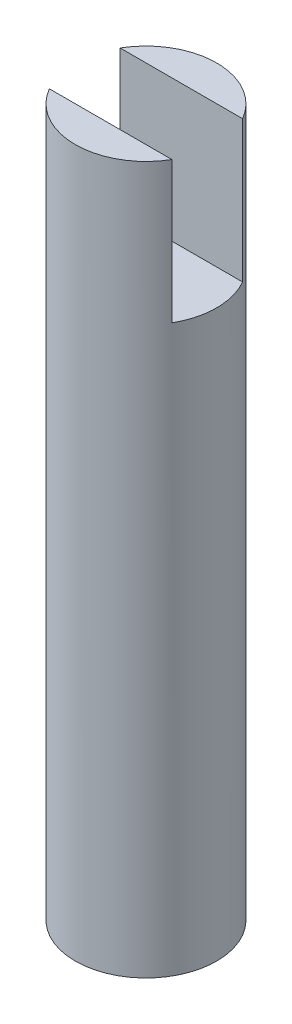
ISO-10303-21;
HEADER;
FILE_DESCRIPTION(('STEP AP214'),'2;1');
FILE_NAME('part.step','',(''),(''),'','','');
FILE_SCHEMA(('AUTOMOTIVE_DESIGN { 1 0 10303 214 1 1 1 1 }'));
ENDSEC;
DATA;
#1=APPLICATION_CONTEXT('core data for automotive mechanical design processes');
#2=APPLICATION_PROTOCOL_DEFINITION('international standard','automotive_design',2000,#1);
#3=PRODUCT_CONTEXT('',#1,'mechanical');
#4=PRODUCT('Part','Part','',(#3));
#5=PRODUCT_RELATED_PRODUCT_CATEGORY('part','',(#4));
#6=PRODUCT_DEFINITION_FORMATION('','',#4);
#7=PRODUCT_DEFINITION_CONTEXT('part definition',#1,'design');
#8=PRODUCT_DEFINITION('design','',#6,#7);
#9=PRODUCT_DEFINITION_SHAPE('','',#8);
#10=(LENGTH_UNIT() NAMED_UNIT(*) SI_UNIT(.MILLI.,.METRE.));
#11=(NAMED_UNIT(*) PLANE_ANGLE_UNIT() SI_UNIT($,.RADIAN.));
#12=(NAMED_UNIT(*) SI_UNIT($,.STERADIAN.) SOLID_ANGLE_UNIT());
#13=UNCERTAINTY_MEASURE_WITH_UNIT(LENGTH_MEASURE(1.E-05),#10,'distance_accuracy_value','');
#14=(GEOMETRIC_REPRESENTATION_CONTEXT(3) GLOBAL_UNCERTAINTY_ASSIGNED_CONTEXT((#13)) GLOBAL_UNIT_ASSIGNED_CONTEXT((#10,
#11,#12)) REPRESENTATION_CONTEXT('',''));
#15=CARTESIAN_POINT('',(0.,0.,0.));
#16=DIRECTION('',(0.,0.,1.));
#17=DIRECTION('',(1.,0.,0.));
#18=AXIS2_PLACEMENT_3D('',#15,#16,#17);
#19=CARTESIAN_POINT('',(0.,5.,0.));
#20=DIRECTION('',(0.,1.,0.));
#21=DIRECTION('',(0.,0.,1.));
#22=AXIS2_PLACEMENT_3D('',#19,#20,#21);
#23=PLANE('',#22);
#24=DIRECTION('',(1.,0.,0.));
#25=VECTOR('',#24,1.);
#26=CARTESIAN_POINT('',(0.,5.,2.5));
#27=LINE('',#26,#25);
#28=CARTESIAN_POINT('',(-4.33012701892219,5.,2.5));
#29=VERTEX_POINT('',#28);
#30=CARTESIAN_POINT('',(4.33012701892219,5.,2.5));
#31=VERTEX_POINT('',#30);
#32=EDGE_CURVE('E63',#29,#31,#27,.T.);
#33=ORIENTED_EDGE('',*,*,#32,.F.);
#34=CARTESIAN_POINT('',(0.,5.,0.));
#35=DIRECTION('',(0.,1.,0.));
#36=DIRECTION('',(0.,0.,1.));
#37=AXIS2_PLACEMENT_3D('',#34,#35,#36);
#38=CIRCLE('',#37,5.);
#39=EDGE_CURVE('E97',#29,#31,#38,.T.);
#40=ORIENTED_EDGE('',*,*,#39,.T.);
#41=EDGE_LOOP('',(#33,#40));
#42=FACE_BOUND('',#41,.T.);
#43=ADVANCED_FACE('F40',(#42),#23,.T.);
#44=CARTESIAN_POINT('',(0.,-45.,0.));
#45=DIRECTION('',(0.,1.,0.));
#46=DIRECTION('',(0.,0.,1.));
#47=AXIS2_PLACEMENT_3D('',#44,#45,#46);
#48=CYLINDRICAL_SURFACE('',#47,5.);
#49=DIRECTION('',(0.,1.,0.));
#50=VECTOR('',#49,1.);
#51=CARTESIAN_POINT('',(-4.3301270189222,-45.,-2.5));
#52=LINE('',#51,#50);
#53=CARTESIAN_POINT('',(-4.33012701892219,5.,-2.5));
#54=VERTEX_POINT('',#53);
#55=CARTESIAN_POINT('',(-4.33012701892219,-5.,-2.5));
#56=VERTEX_POINT('',#55);
#57=EDGE_CURVE('E83',#54,#56,#52,.F.);
#58=ORIENTED_EDGE('',*,*,#57,.F.);
#59=CARTESIAN_POINT('',(4.33012701892219,5.,-2.5));
#60=VERTEX_POINT('',#59);
#61=EDGE_CURVE('E92',#60,#54,#38,.T.);
#62=ORIENTED_EDGE('',*,*,#61,.F.);
#63=DIRECTION('',(0.,1.,0.));
#64=VECTOR('',#63,1.);
#65=CARTESIAN_POINT('',(4.3301270189222,-45.,-2.5));
#66=LINE('',#65,#64);
#67=CARTESIAN_POINT('',(4.33012701892219,-5.,-2.5));
#68=VERTEX_POINT('',#67);
#69=EDGE_CURVE('E55',#68,#60,#66,.T.);
#70=ORIENTED_EDGE('',*,*,#69,.F.);
#71=CARTESIAN_POINT('',(0.,-5.,0.));
#72=DIRECTION('',(0.,-1.,0.));
#73=DIRECTION('',(0.,0.,-1.));
#74=AXIS2_PLACEMENT_3D('',#71,#72,#73);
#75=CIRCLE('',#74,5.);
#76=CARTESIAN_POINT('',(4.33012701892219,-5.,2.5));
#77=VERTEX_POINT('',#76);
#78=EDGE_CURVE('E44',#77,#68,#75,.F.);
#79=ORIENTED_EDGE('',*,*,#78,.F.);
#80=DIRECTION('',(0.,1.,0.));
#81=VECTOR('',#80,1.);
#82=CARTESIAN_POINT('',(4.33012701892219,-45.,2.5));
#83=LINE('',#82,#81);
#84=EDGE_CURVE('E102',#31,#77,#83,.F.);
#85=ORIENTED_EDGE('',*,*,#84,.F.);
#86=ORIENTED_EDGE('',*,*,#39,.F.);
#87=DIRECTION('',(0.,1.,0.));
#88=VECTOR('',#87,1.);
#89=CARTESIAN_POINT('',(-4.33012701892219,-45.,2.5));
#90=LINE('',#89,#88);
#91=CARTESIAN_POINT('',(-4.33012701892219,-5.,2.5));
#92=VERTEX_POINT('',#91);
#93=EDGE_CURVE('E94',#92,#29,#90,.T.);
#94=ORIENTED_EDGE('',*,*,#93,.F.);
#95=EDGE_CURVE('E12',#56,#92,#75,.F.);
#96=ORIENTED_EDGE('',*,*,#95,.F.);
#97=EDGE_LOOP('',(#58,#62,#70,#79,#85,#86,#94,#96));
#98=FACE_BOUND('',#97,.T.);
#99=CARTESIAN_POINT('',(0.,-45.,0.));
#100=DIRECTION('',(0.,1.,0.));
#101=DIRECTION('',(0.,0.,1.));
#102=AXIS2_PLACEMENT_3D('',#99,#100,#101);
#103=CIRCLE('',#102,5.);
#104=CARTESIAN_POINT('',(0.,-45.,5.));
#105=VERTEX_POINT('',#104);
#106=EDGE_CURVE('E88',#105,#105,#103,.T.);
#107=ORIENTED_EDGE('',*,*,#106,.T.);
#108=EDGE_LOOP('',(#107));
#109=FACE_BOUND('',#108,.T.);
#110=ADVANCED_FACE('F42',(#98,#109),#48,.T.);
#111=CARTESIAN_POINT('',(0.,-45.,0.));
#112=DIRECTION('',(0.,1.,0.));
#113=DIRECTION('',(0.,0.,1.));
#114=AXIS2_PLACEMENT_3D('',#111,#112,#113);
#115=PLANE('',#114);
#116=ORIENTED_EDGE('',*,*,#106,.F.);
#117=EDGE_LOOP('',(#116));
#118=FACE_BOUND('',#117,.T.);
#119=ADVANCED_FACE('F122',(#118),#115,.F.);
#120=DIRECTION('',(-1.,0.,0.));
#121=VECTOR('',#120,1.);
#122=CARTESIAN_POINT('',(0.,5.,-2.5));
#123=LINE('',#122,#121);
#124=EDGE_CURVE('E80',#60,#54,#123,.T.);
#125=ORIENTED_EDGE('',*,*,#124,.F.);
#126=ORIENTED_EDGE('',*,*,#61,.T.);
#127=EDGE_LOOP('',(#125,#126));
#128=FACE_BOUND('',#127,.T.);
#129=ADVANCED_FACE('F96',(#128),#23,.T.);
#130=CARTESIAN_POINT('',(-5.,5.,2.5));
#131=DIRECTION('',(0.,0.,1.));
#132=DIRECTION('',(1.,0.,0.));
#133=AXIS2_PLACEMENT_3D('',#130,#131,#132);
#134=PLANE('',#133);
#135=ORIENTED_EDGE('',*,*,#84,.T.);
#136=DIRECTION('',(1.,0.,0.));
#137=VECTOR('',#136,1.);
#138=CARTESIAN_POINT('',(-5.,-5.,2.5));
#139=LINE('',#138,#137);
#140=EDGE_CURVE('E110',#92,#77,#139,.T.);
#141=ORIENTED_EDGE('',*,*,#140,.F.);
#142=ORIENTED_EDGE('',*,*,#93,.T.);
#143=ORIENTED_EDGE('',*,*,#32,.T.);
#144=EDGE_LOOP('',(#135,#141,#142,#143));
#145=FACE_BOUND('',#144,.T.);
#146=ADVANCED_FACE('F114',(#145),#134,.F.);
#147=CARTESIAN_POINT('',(-5.,5.,-2.5));
#148=DIRECTION('',(0.,0.,-1.));
#149=DIRECTION('',(0.,1.,0.));
#150=AXIS2_PLACEMENT_3D('',#147,#148,#149);
#151=PLANE('',#150);
#152=ORIENTED_EDGE('',*,*,#57,.T.);
#153=DIRECTION('',(1.,0.,0.));
#154=VECTOR('',#153,1.);
#155=CARTESIAN_POINT('',(-5.,-5.,-2.5));
#156=LINE('',#155,#154);
#157=EDGE_CURVE('E108',#56,#68,#156,.T.);
#158=ORIENTED_EDGE('',*,*,#157,.T.);
#159=ORIENTED_EDGE('',*,*,#69,.T.);
#160=ORIENTED_EDGE('',*,*,#124,.T.);
#161=EDGE_LOOP('',(#152,#158,#159,#160));
#162=FACE_BOUND('',#161,.T.);
#163=ADVANCED_FACE('F82',(#162),#151,.F.);
#164=CARTESIAN_POINT('',(-5.,-5.,2.5));
#165=DIRECTION('',(0.,-1.,0.));
#166=DIRECTION('',(0.,0.,-1.));
#167=AXIS2_PLACEMENT_3D('',#164,#165,#166);
#168=PLANE('',#167);
#169=ORIENTED_EDGE('',*,*,#157,.F.);
#170=ORIENTED_EDGE('',*,*,#95,.T.);
#171=ORIENTED_EDGE('',*,*,#140,.T.);
#172=ORIENTED_EDGE('',*,*,#78,.T.);
#173=EDGE_LOOP('',(#169,#170,#171,#172));
#174=FACE_BOUND('',#173,.T.);
#175=ADVANCED_FACE('F107',(#174),#168,.F.);
#176=CLOSED_SHELL('',(#43,#110,#119,#129,#146,#163,#175));
#177=MANIFOLD_SOLID_BREP('B2',#176);
#178=ADVANCED_BREP_SHAPE_REPRESENTATION('',(#18,#177),#14);
#179=SHAPE_DEFINITION_REPRESENTATION(#9,#178);
ENDSEC;
END-ISO-10303-21;
